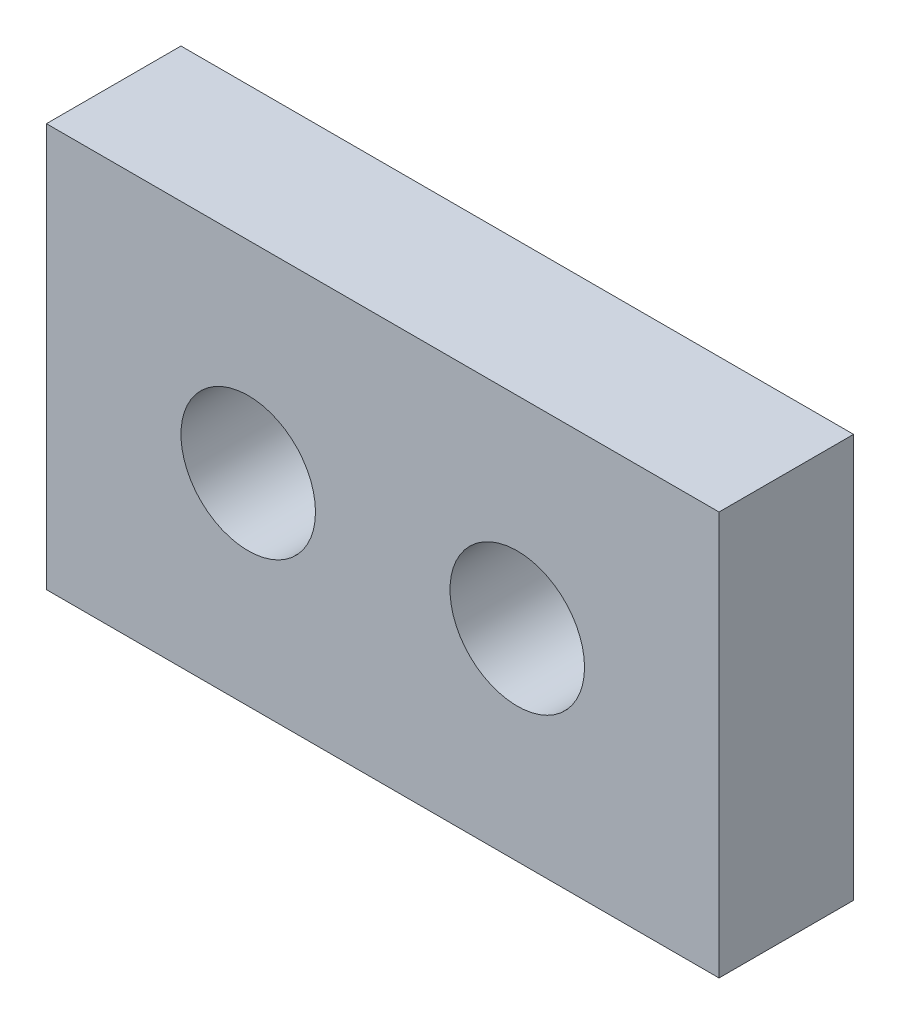
ISO-10303-21;
HEADER;
FILE_DESCRIPTION(('STEP AP214'),'2;1');
FILE_NAME('part.step','',(''),(''),'','','');
FILE_SCHEMA(('AUTOMOTIVE_DESIGN { 1 0 10303 214 1 1 1 1 }'));
ENDSEC;
DATA;
#1=APPLICATION_CONTEXT('core data for automotive mechanical design processes');
#2=APPLICATION_PROTOCOL_DEFINITION('international standard','automotive_design',2000,#1);
#3=PRODUCT_CONTEXT('',#1,'mechanical');
#4=PRODUCT('Part','Part','',(#3));
#5=PRODUCT_RELATED_PRODUCT_CATEGORY('part','',(#4));
#6=PRODUCT_DEFINITION_FORMATION('','',#4);
#7=PRODUCT_DEFINITION_CONTEXT('part definition',#1,'design');
#8=PRODUCT_DEFINITION('design','',#6,#7);
#9=PRODUCT_DEFINITION_SHAPE('','',#8);
#10=(LENGTH_UNIT() NAMED_UNIT(*) SI_UNIT(.MILLI.,.METRE.));
#11=(NAMED_UNIT(*) PLANE_ANGLE_UNIT() SI_UNIT($,.RADIAN.));
#12=(NAMED_UNIT(*) SI_UNIT($,.STERADIAN.) SOLID_ANGLE_UNIT());
#13=UNCERTAINTY_MEASURE_WITH_UNIT(LENGTH_MEASURE(1.E-05),#10,'distance_accuracy_value','');
#14=(GEOMETRIC_REPRESENTATION_CONTEXT(3) GLOBAL_UNCERTAINTY_ASSIGNED_CONTEXT((#13)) GLOBAL_UNIT_ASSIGNED_CONTEXT((#10,
#11,#12)) REPRESENTATION_CONTEXT('',''));
#15=CARTESIAN_POINT('',(0.,0.,0.));
#16=DIRECTION('',(0.,0.,1.));
#17=DIRECTION('',(1.,0.,0.));
#18=AXIS2_PLACEMENT_3D('',#15,#16,#17);
#19=CARTESIAN_POINT('',(0.,0.,10.));
#20=DIRECTION('',(1.,0.,0.));
#21=DIRECTION('',(0.,0.,-1.));
#22=AXIS2_PLACEMENT_3D('',#19,#20,#21);
#23=PLANE('',#22);
#24=DIRECTION('',(0.,-1.,0.));
#25=VECTOR('',#24,1.);
#26=CARTESIAN_POINT('',(0.,0.,0.));
#27=LINE('',#26,#25);
#28=CARTESIAN_POINT('',(0.,30.,0.));
#29=VERTEX_POINT('',#28);
#30=CARTESIAN_POINT('',(0.,0.,0.));
#31=VERTEX_POINT('',#30);
#32=EDGE_CURVE('E98',#29,#31,#27,.T.);
#33=ORIENTED_EDGE('',*,*,#32,.T.);
#34=DIRECTION('',(0.,0.,-1.));
#35=VECTOR('',#34,1.);
#36=CARTESIAN_POINT('',(0.,0.,10.));
#37=LINE('',#36,#35);
#38=CARTESIAN_POINT('',(0.,0.,10.));
#39=VERTEX_POINT('',#38);
#40=EDGE_CURVE('E11',#39,#31,#37,.T.);
#41=ORIENTED_EDGE('',*,*,#40,.F.);
#42=DIRECTION('',(0.,-1.,0.));
#43=VECTOR('',#42,1.);
#44=CARTESIAN_POINT('',(0.,0.,10.));
#45=LINE('',#44,#43);
#46=CARTESIAN_POINT('',(0.,30.,10.));
#47=VERTEX_POINT('',#46);
#48=EDGE_CURVE('E86',#47,#39,#45,.T.);
#49=ORIENTED_EDGE('',*,*,#48,.F.);
#50=DIRECTION('',(0.,0.,-1.));
#51=VECTOR('',#50,1.);
#52=CARTESIAN_POINT('',(0.,30.,10.));
#53=LINE('',#52,#51);
#54=EDGE_CURVE('E94',#47,#29,#53,.T.);
#55=ORIENTED_EDGE('',*,*,#54,.T.);
#56=EDGE_LOOP('',(#33,#41,#49,#55));
#57=FACE_BOUND('',#56,.T.);
#58=ADVANCED_FACE('F35',(#57),#23,.F.);
#59=CARTESIAN_POINT('',(0.,0.,10.));
#60=DIRECTION('',(0.,1.,0.));
#61=DIRECTION('',(0.,0.,1.));
#62=AXIS2_PLACEMENT_3D('',#59,#60,#61);
#63=PLANE('',#62);
#64=DIRECTION('',(1.,0.,0.));
#65=VECTOR('',#64,1.);
#66=CARTESIAN_POINT('',(0.,0.,0.));
#67=LINE('',#66,#65);
#68=CARTESIAN_POINT('',(50.,0.,0.));
#69=VERTEX_POINT('',#68);
#70=EDGE_CURVE('E90',#31,#69,#67,.T.);
#71=ORIENTED_EDGE('',*,*,#70,.T.);
#72=DIRECTION('',(0.,0.,-1.));
#73=VECTOR('',#72,1.);
#74=CARTESIAN_POINT('',(50.,0.,10.));
#75=LINE('',#74,#73);
#76=CARTESIAN_POINT('',(50.,0.,10.));
#77=VERTEX_POINT('',#76);
#78=EDGE_CURVE('E43',#77,#69,#75,.T.);
#79=ORIENTED_EDGE('',*,*,#78,.F.);
#80=DIRECTION('',(1.,0.,0.));
#81=VECTOR('',#80,1.);
#82=CARTESIAN_POINT('',(0.,0.,10.));
#83=LINE('',#82,#81);
#84=EDGE_CURVE('E81',#39,#77,#83,.T.);
#85=ORIENTED_EDGE('',*,*,#84,.F.);
#86=ORIENTED_EDGE('',*,*,#40,.T.);
#87=EDGE_LOOP('',(#71,#79,#85,#86));
#88=FACE_BOUND('',#87,.T.);
#89=ADVANCED_FACE('F89',(#88),#63,.F.);
#90=CARTESIAN_POINT('',(50.,0.,10.));
#91=DIRECTION('',(-1.,0.,0.));
#92=DIRECTION('',(0.,0.,1.));
#93=AXIS2_PLACEMENT_3D('',#90,#91,#92);
#94=PLANE('',#93);
#95=DIRECTION('',(0.,1.,0.));
#96=VECTOR('',#95,1.);
#97=CARTESIAN_POINT('',(50.,0.,0.));
#98=LINE('',#97,#96);
#99=CARTESIAN_POINT('',(50.,30.,0.));
#100=VERTEX_POINT('',#99);
#101=EDGE_CURVE('E68',#69,#100,#98,.T.);
#102=ORIENTED_EDGE('',*,*,#101,.T.);
#103=DIRECTION('',(0.,0.,-1.));
#104=VECTOR('',#103,1.);
#105=CARTESIAN_POINT('',(50.,30.,10.));
#106=LINE('',#105,#104);
#107=CARTESIAN_POINT('',(50.,30.,10.));
#108=VERTEX_POINT('',#107);
#109=EDGE_CURVE('E91',#108,#100,#106,.T.);
#110=ORIENTED_EDGE('',*,*,#109,.F.);
#111=DIRECTION('',(0.,1.,0.));
#112=VECTOR('',#111,1.);
#113=CARTESIAN_POINT('',(50.,0.,10.));
#114=LINE('',#113,#112);
#115=EDGE_CURVE('E84',#77,#108,#114,.T.);
#116=ORIENTED_EDGE('',*,*,#115,.F.);
#117=ORIENTED_EDGE('',*,*,#78,.T.);
#118=EDGE_LOOP('',(#102,#110,#116,#117));
#119=FACE_BOUND('',#118,.T.);
#120=ADVANCED_FACE('F92',(#119),#94,.F.);
#121=CARTESIAN_POINT('',(0.,30.,10.));
#122=DIRECTION('',(0.,-1.,0.));
#123=DIRECTION('',(0.,0.,-1.));
#124=AXIS2_PLACEMENT_3D('',#121,#122,#123);
#125=PLANE('',#124);
#126=DIRECTION('',(-1.,0.,0.));
#127=VECTOR('',#126,1.);
#128=CARTESIAN_POINT('',(0.,30.,0.));
#129=LINE('',#128,#127);
#130=EDGE_CURVE('E74',#100,#29,#129,.T.);
#131=ORIENTED_EDGE('',*,*,#130,.T.);
#132=ORIENTED_EDGE('',*,*,#54,.F.);
#133=DIRECTION('',(-1.,0.,0.));
#134=VECTOR('',#133,1.);
#135=CARTESIAN_POINT('',(0.,30.,10.));
#136=LINE('',#135,#134);
#137=EDGE_CURVE('E51',#108,#47,#136,.T.);
#138=ORIENTED_EDGE('',*,*,#137,.F.);
#139=ORIENTED_EDGE('',*,*,#109,.T.);
#140=EDGE_LOOP('',(#131,#132,#138,#139));
#141=FACE_BOUND('',#140,.T.);
#142=ADVANCED_FACE('F106',(#141),#125,.F.);
#143=CARTESIAN_POINT('',(0.,30.,10.));
#144=DIRECTION('',(0.,0.,-1.));
#145=DIRECTION('',(-1.,0.,0.));
#146=AXIS2_PLACEMENT_3D('',#143,#144,#145);
#147=PLANE('',#146);
#148=CARTESIAN_POINT('',(35.,15.,10.));
#149=DIRECTION('',(0.,0.,1.));
#150=DIRECTION('',(1.,0.,0.));
#151=AXIS2_PLACEMENT_3D('',#148,#149,#150);
#152=CIRCLE('',#151,5.);
#153=CARTESIAN_POINT('',(40.,15.,10.));
#154=VERTEX_POINT('',#153);
#155=EDGE_CURVE('E118',#154,#154,#152,.T.);
#156=ORIENTED_EDGE('',*,*,#155,.F.);
#157=EDGE_LOOP('',(#156));
#158=FACE_BOUND('',#157,.T.);
#159=CARTESIAN_POINT('',(15.,15.,10.));
#160=DIRECTION('',(0.,0.,1.));
#161=DIRECTION('',(1.,0.,0.));
#162=AXIS2_PLACEMENT_3D('',#159,#160,#161);
#163=CIRCLE('',#162,5.);
#164=CARTESIAN_POINT('',(20.,15.,10.));
#165=VERTEX_POINT('',#164);
#166=EDGE_CURVE('E112',#165,#165,#163,.T.);
#167=ORIENTED_EDGE('',*,*,#166,.F.);
#168=EDGE_LOOP('',(#167));
#169=FACE_BOUND('',#168,.T.);
#170=ORIENTED_EDGE('',*,*,#48,.T.);
#171=ORIENTED_EDGE('',*,*,#84,.T.);
#172=ORIENTED_EDGE('',*,*,#115,.T.);
#173=ORIENTED_EDGE('',*,*,#137,.T.);
#174=EDGE_LOOP('',(#170,#171,#172,#173));
#175=FACE_BOUND('',#174,.T.);
#176=ADVANCED_FACE('F82',(#158,#169,#175),#147,.F.);
#177=CARTESIAN_POINT('',(0.,30.,0.));
#178=DIRECTION('',(0.,0.,-1.));
#179=DIRECTION('',(-1.,0.,0.));
#180=AXIS2_PLACEMENT_3D('',#177,#178,#179);
#181=PLANE('',#180);
#182=CARTESIAN_POINT('',(35.,15.,0.));
#183=DIRECTION('',(0.,0.,1.));
#184=DIRECTION('',(1.,0.,0.));
#185=AXIS2_PLACEMENT_3D('',#182,#183,#184);
#186=CIRCLE('',#185,5.);
#187=CARTESIAN_POINT('',(40.,15.,0.));
#188=VERTEX_POINT('',#187);
#189=EDGE_CURVE('E115',#188,#188,#186,.T.);
#190=ORIENTED_EDGE('',*,*,#189,.T.);
#191=EDGE_LOOP('',(#190));
#192=FACE_BOUND('',#191,.T.);
#193=CARTESIAN_POINT('',(15.,15.,0.));
#194=DIRECTION('',(0.,0.,1.));
#195=DIRECTION('',(1.,0.,0.));
#196=AXIS2_PLACEMENT_3D('',#193,#194,#195);
#197=CIRCLE('',#196,5.);
#198=CARTESIAN_POINT('',(20.,15.,0.));
#199=VERTEX_POINT('',#198);
#200=EDGE_CURVE('E101',#199,#199,#197,.T.);
#201=ORIENTED_EDGE('',*,*,#200,.T.);
#202=EDGE_LOOP('',(#201));
#203=FACE_BOUND('',#202,.T.);
#204=ORIENTED_EDGE('',*,*,#32,.F.);
#205=ORIENTED_EDGE('',*,*,#130,.F.);
#206=ORIENTED_EDGE('',*,*,#101,.F.);
#207=ORIENTED_EDGE('',*,*,#70,.F.);
#208=EDGE_LOOP('',(#204,#205,#206,#207));
#209=FACE_BOUND('',#208,.T.);
#210=ADVANCED_FACE('F109',(#192,#203,#209),#181,.T.);
#211=CARTESIAN_POINT('',(15.,15.,0.));
#212=DIRECTION('',(0.,0.,1.));
#213=DIRECTION('',(1.,0.,0.));
#214=AXIS2_PLACEMENT_3D('',#211,#212,#213);
#215=CYLINDRICAL_SURFACE('',#214,5.);
#216=ORIENTED_EDGE('',*,*,#200,.F.);
#217=EDGE_LOOP('',(#216));
#218=FACE_BOUND('',#217,.T.);
#219=ORIENTED_EDGE('',*,*,#166,.T.);
#220=EDGE_LOOP('',(#219));
#221=FACE_BOUND('',#220,.T.);
#222=ADVANCED_FACE('F129',(#218,#221),#215,.F.);
#223=CARTESIAN_POINT('',(35.,15.,0.));
#224=DIRECTION('',(0.,0.,1.));
#225=DIRECTION('',(1.,0.,0.));
#226=AXIS2_PLACEMENT_3D('',#223,#224,#225);
#227=CYLINDRICAL_SURFACE('',#226,5.);
#228=ORIENTED_EDGE('',*,*,#189,.F.);
#229=EDGE_LOOP('',(#228));
#230=FACE_BOUND('',#229,.T.);
#231=ORIENTED_EDGE('',*,*,#155,.T.);
#232=EDGE_LOOP('',(#231));
#233=FACE_BOUND('',#232,.T.);
#234=ADVANCED_FACE('F126',(#230,#233),#227,.F.);
#235=CLOSED_SHELL('',(#58,#89,#120,#142,#176,#210,#222,#234));
#236=MANIFOLD_SOLID_BREP('B2',#235);
#237=ADVANCED_BREP_SHAPE_REPRESENTATION('',(#18,#236),#14);
#238=SHAPE_DEFINITION_REPRESENTATION(#9,#237);
ENDSEC;
END-ISO-10303-21;
